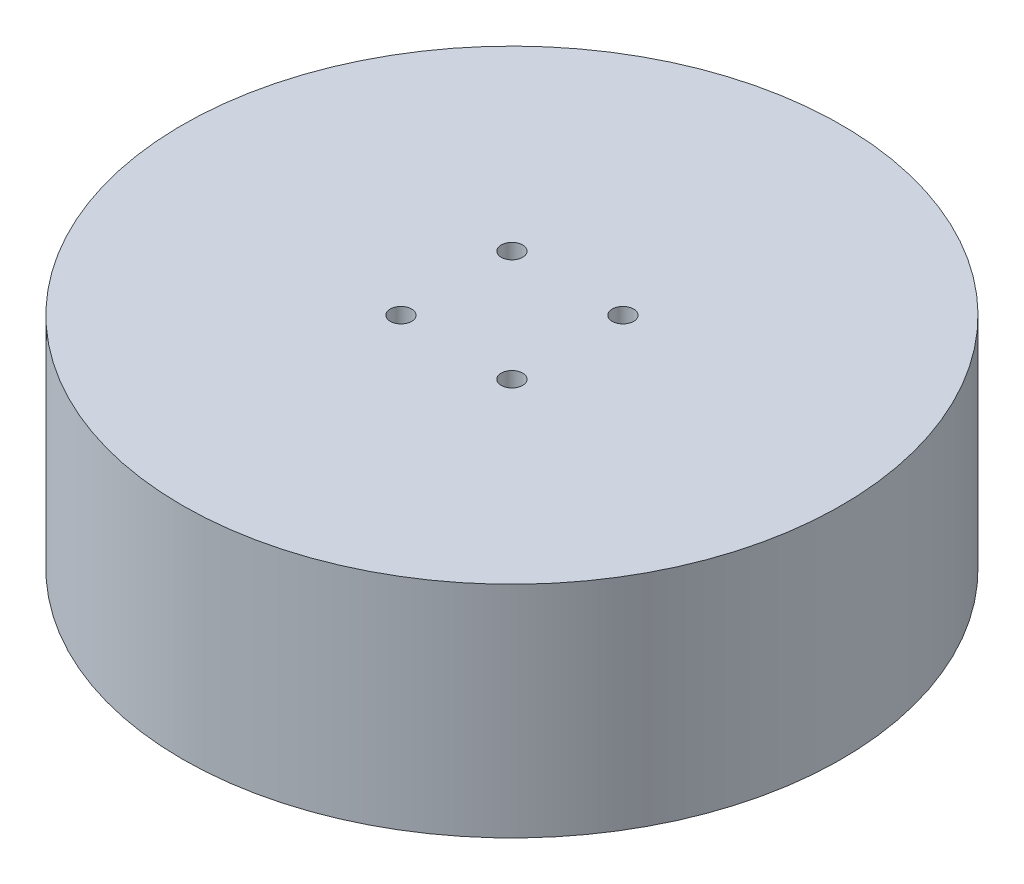
ISO-10303-21;
HEADER;
FILE_DESCRIPTION(('STEP AP214'),'2;1');
FILE_NAME('part.step','',(''),(''),'','','');
FILE_SCHEMA(('AUTOMOTIVE_DESIGN { 1 0 10303 214 1 1 1 1 }'));
ENDSEC;
DATA;
#1=APPLICATION_CONTEXT('core data for automotive mechanical design processes');
#2=APPLICATION_PROTOCOL_DEFINITION('international standard','automotive_design',2000,#1);
#3=PRODUCT_CONTEXT('',#1,'mechanical');
#4=PRODUCT('Part','Part','',(#3));
#5=PRODUCT_RELATED_PRODUCT_CATEGORY('part','',(#4));
#6=PRODUCT_DEFINITION_FORMATION('','',#4);
#7=PRODUCT_DEFINITION_CONTEXT('part definition',#1,'design');
#8=PRODUCT_DEFINITION('design','',#6,#7);
#9=PRODUCT_DEFINITION_SHAPE('','',#8);
#10=(LENGTH_UNIT() NAMED_UNIT(*) SI_UNIT(.MILLI.,.METRE.));
#11=(NAMED_UNIT(*) PLANE_ANGLE_UNIT() SI_UNIT($,.RADIAN.));
#12=(NAMED_UNIT(*) SI_UNIT($,.STERADIAN.) SOLID_ANGLE_UNIT());
#13=UNCERTAINTY_MEASURE_WITH_UNIT(LENGTH_MEASURE(1.E-05),#10,'distance_accuracy_value','');
#14=(GEOMETRIC_REPRESENTATION_CONTEXT(3) GLOBAL_UNCERTAINTY_ASSIGNED_CONTEXT((#13)) GLOBAL_UNIT_ASSIGNED_CONTEXT((#10,
#11,#12)) REPRESENTATION_CONTEXT('',''));
#15=CARTESIAN_POINT('',(0.,0.,0.));
#16=DIRECTION('',(0.,0.,1.));
#17=DIRECTION('',(1.,0.,0.));
#18=AXIS2_PLACEMENT_3D('',#15,#16,#17);
#19=CARTESIAN_POINT('',(0.,21.,0.));
#20=DIRECTION('',(0.,-1.,0.));
#21=DIRECTION('',(0.,0.,-1.));
#22=AXIS2_PLACEMENT_3D('',#19,#20,#21);
#23=CYLINDRICAL_SURFACE('',#22,31.5);
#24=CARTESIAN_POINT('',(0.,21.,0.));
#25=DIRECTION('',(0.,1.,0.));
#26=DIRECTION('',(0.,0.,1.));
#27=AXIS2_PLACEMENT_3D('',#24,#25,#26);
#28=CIRCLE('',#27,31.5);
#29=CARTESIAN_POINT('',(0.,21.,31.5));
#30=VERTEX_POINT('',#29);
#31=EDGE_CURVE('E11',#30,#30,#28,.T.);
#32=ORIENTED_EDGE('',*,*,#31,.F.);
#33=EDGE_LOOP('',(#32));
#34=FACE_BOUND('',#33,.T.);
#35=CARTESIAN_POINT('',(0.,0.,0.));
#36=DIRECTION('',(0.,1.,0.));
#37=DIRECTION('',(0.,0.,1.));
#38=AXIS2_PLACEMENT_3D('',#35,#36,#37);
#39=CIRCLE('',#38,31.5);
#40=CARTESIAN_POINT('',(0.,0.,31.5));
#41=VERTEX_POINT('',#40);
#42=EDGE_CURVE('E36',#41,#41,#39,.T.);
#43=ORIENTED_EDGE('',*,*,#42,.T.);
#44=EDGE_LOOP('',(#43));
#45=FACE_BOUND('',#44,.T.);
#46=ADVANCED_FACE('F33',(#34,#45),#23,.T.);
#47=CARTESIAN_POINT('',(0.,21.,0.));
#48=DIRECTION('',(0.,1.,0.));
#49=DIRECTION('',(0.,0.,1.));
#50=AXIS2_PLACEMENT_3D('',#47,#48,#49);
#51=PLANE('',#50);
#52=CARTESIAN_POINT('',(-5.30330085889914,21.,-5.30330085889908));
#53=DIRECTION('',(0.,1.,0.));
#54=DIRECTION('',(0.,0.,1.));
#55=AXIS2_PLACEMENT_3D('',#52,#53,#54);
#56=CIRCLE('',#55,1.02499999999999);
#57=CARTESIAN_POINT('',(-5.30330085889914,21.,-4.27830085889909));
#58=VERTEX_POINT('',#57);
#59=EDGE_CURVE('E64',#58,#58,#56,.T.);
#60=ORIENTED_EDGE('',*,*,#59,.F.);
#61=EDGE_LOOP('',(#60));
#62=FACE_BOUND('',#61,.T.);
#63=CARTESIAN_POINT('',(5.3033008588991,21.,-5.30330085889912));
#64=DIRECTION('',(0.,1.,0.));
#65=DIRECTION('',(0.,0.,1.));
#66=AXIS2_PLACEMENT_3D('',#63,#64,#65);
#67=CIRCLE('',#66,1.02499999999999);
#68=CARTESIAN_POINT('',(5.3033008588991,21.,-4.27830085889913));
#69=VERTEX_POINT('',#68);
#70=EDGE_CURVE('E63',#69,#69,#67,.T.);
#71=ORIENTED_EDGE('',*,*,#70,.F.);
#72=EDGE_LOOP('',(#71));
#73=FACE_BOUND('',#72,.T.);
#74=CARTESIAN_POINT('',(5.30330085889911,21.,5.30330085889911));
#75=DIRECTION('',(0.,1.,0.));
#76=DIRECTION('',(0.,0.,1.));
#77=AXIS2_PLACEMENT_3D('',#74,#75,#76);
#78=CIRCLE('',#77,1.02499999999999);
#79=CARTESIAN_POINT('',(5.30330085889911,21.,6.3283008588991));
#80=VERTEX_POINT('',#79);
#81=EDGE_CURVE('E76',#80,#80,#78,.T.);
#82=ORIENTED_EDGE('',*,*,#81,.F.);
#83=EDGE_LOOP('',(#82));
#84=FACE_BOUND('',#83,.T.);
#85=CARTESIAN_POINT('',(-5.30330085889914,21.,5.30330085889908));
#86=DIRECTION('',(0.,1.,0.));
#87=DIRECTION('',(0.,0.,1.));
#88=AXIS2_PLACEMENT_3D('',#85,#86,#87);
#89=CIRCLE('',#88,1.02499999999999);
#90=CARTESIAN_POINT('',(-5.30330085889914,21.,6.32830085889907));
#91=VERTEX_POINT('',#90);
#92=EDGE_CURVE('E82',#91,#91,#89,.T.);
#93=ORIENTED_EDGE('',*,*,#92,.F.);
#94=EDGE_LOOP('',(#93));
#95=FACE_BOUND('',#94,.T.);
#96=ORIENTED_EDGE('',*,*,#31,.T.);
#97=EDGE_LOOP('',(#96));
#98=FACE_BOUND('',#97,.T.);
#99=ADVANCED_FACE('F96',(#62,#73,#84,#95,#98),#51,.T.);
#100=CARTESIAN_POINT('',(0.,0.,0.));
#101=DIRECTION('',(0.,1.,0.));
#102=DIRECTION('',(0.,0.,1.));
#103=AXIS2_PLACEMENT_3D('',#100,#101,#102);
#104=PLANE('',#103);
#105=CARTESIAN_POINT('',(0.,0.,0.));
#106=DIRECTION('',(0.,-1.,0.));
#107=DIRECTION('',(0.,0.,-1.));
#108=AXIS2_PLACEMENT_3D('',#105,#106,#107);
#109=CIRCLE('',#108,27.);
#110=CARTESIAN_POINT('',(0.,0.,-27.));
#111=VERTEX_POINT('',#110);
#112=EDGE_CURVE('E214',#111,#111,#109,.T.);
#113=ORIENTED_EDGE('',*,*,#112,.F.);
#114=EDGE_LOOP('',(#113));
#115=FACE_BOUND('',#114,.T.);
#116=ORIENTED_EDGE('',*,*,#42,.F.);
#117=EDGE_LOOP('',(#116));
#118=FACE_BOUND('',#117,.T.);
#119=ADVANCED_FACE('F93',(#115,#118),#104,.F.);
#120=CARTESIAN_POINT('',(-5.30330085889914,14.,5.30330085889908));
#121=DIRECTION('',(0.,1.,0.));
#122=DIRECTION('',(0.,0.,1.));
#123=AXIS2_PLACEMENT_3D('',#120,#121,#122);
#124=CONICAL_SURFACE('',#123,1.02499999999999,1.02974425867664);
#125=CARTESIAN_POINT('',(-5.30330085889914,13.3841178654968,5.30330085889908));
#126=VERTEX_POINT('',#125);
#127=VERTEX_LOOP('',#126);
#128=FACE_BOUND('',#127,.T.);
#129=CARTESIAN_POINT('',(-5.30330085889914,14.,5.30330085889908));
#130=DIRECTION('',(0.,1.,0.));
#131=DIRECTION('',(0.,0.,1.));
#132=AXIS2_PLACEMENT_3D('',#129,#130,#131);
#133=CIRCLE('',#132,1.02499999999999);
#134=CARTESIAN_POINT('',(-5.30330085889914,14.,6.32830085889907));
#135=VERTEX_POINT('',#134);
#136=EDGE_CURVE('E85',#135,#135,#133,.T.);
#137=ORIENTED_EDGE('',*,*,#136,.T.);
#138=EDGE_LOOP('',(#137));
#139=FACE_BOUND('',#138,.T.);
#140=ADVANCED_FACE('F95',(#128,#139),#124,.F.);
#141=CARTESIAN_POINT('',(-5.30330085889914,21.,5.30330085889908));
#142=DIRECTION('',(0.,1.,0.));
#143=DIRECTION('',(0.,0.,1.));
#144=AXIS2_PLACEMENT_3D('',#141,#142,#143);
#145=CYLINDRICAL_SURFACE('',#144,1.02499999999999);
#146=ORIENTED_EDGE('',*,*,#136,.F.);
#147=EDGE_LOOP('',(#146));
#148=FACE_BOUND('',#147,.T.);
#149=ORIENTED_EDGE('',*,*,#92,.T.);
#150=EDGE_LOOP('',(#149));
#151=FACE_BOUND('',#150,.T.);
#152=ADVANCED_FACE('F102',(#148,#151),#145,.F.);
#153=CARTESIAN_POINT('',(5.30330085889911,14.,5.30330085889911));
#154=DIRECTION('',(0.,1.,0.));
#155=DIRECTION('',(0.,0.,1.));
#156=AXIS2_PLACEMENT_3D('',#153,#154,#155);
#157=CONICAL_SURFACE('',#156,1.02499999999999,1.02974425867664);
#158=CARTESIAN_POINT('',(5.3033008588991,13.3841178654968,5.30330085889911));
#159=VERTEX_POINT('',#158);
#160=VERTEX_LOOP('',#159);
#161=FACE_BOUND('',#160,.T.);
#162=CARTESIAN_POINT('',(5.30330085889911,14.,5.30330085889911));
#163=DIRECTION('',(0.,1.,0.));
#164=DIRECTION('',(0.,0.,1.));
#165=AXIS2_PLACEMENT_3D('',#162,#163,#164);
#166=CIRCLE('',#165,1.02499999999999);
#167=CARTESIAN_POINT('',(5.30330085889911,14.,6.32830085889909));
#168=VERTEX_POINT('',#167);
#169=EDGE_CURVE('E79',#168,#168,#166,.T.);
#170=ORIENTED_EDGE('',*,*,#169,.T.);
#171=EDGE_LOOP('',(#170));
#172=FACE_BOUND('',#171,.T.);
#173=ADVANCED_FACE('F133',(#161,#172),#157,.F.);
#174=CARTESIAN_POINT('',(5.30330085889911,21.,5.30330085889911));
#175=DIRECTION('',(0.,1.,0.));
#176=DIRECTION('',(0.,0.,1.));
#177=AXIS2_PLACEMENT_3D('',#174,#175,#176);
#178=CYLINDRICAL_SURFACE('',#177,1.02499999999999);
#179=ORIENTED_EDGE('',*,*,#169,.F.);
#180=EDGE_LOOP('',(#179));
#181=FACE_BOUND('',#180,.T.);
#182=ORIENTED_EDGE('',*,*,#81,.T.);
#183=EDGE_LOOP('',(#182));
#184=FACE_BOUND('',#183,.T.);
#185=ADVANCED_FACE('F143',(#181,#184),#178,.F.);
#186=CARTESIAN_POINT('',(5.3033008588991,14.,-5.30330085889912));
#187=DIRECTION('',(0.,1.,0.));
#188=DIRECTION('',(0.,0.,1.));
#189=AXIS2_PLACEMENT_3D('',#186,#187,#188);
#190=CONICAL_SURFACE('',#189,1.02499999999999,1.02974425867664);
#191=CARTESIAN_POINT('',(5.3033008588991,13.3841178654968,-5.30330085889912));
#192=VERTEX_POINT('',#191);
#193=VERTEX_LOOP('',#192);
#194=FACE_BOUND('',#193,.T.);
#195=CARTESIAN_POINT('',(5.3033008588991,14.,-5.30330085889912));
#196=DIRECTION('',(0.,1.,0.));
#197=DIRECTION('',(0.,0.,1.));
#198=AXIS2_PLACEMENT_3D('',#195,#196,#197);
#199=CIRCLE('',#198,1.02499999999999);
#200=CARTESIAN_POINT('',(5.3033008588991,14.,-4.27830085889913));
#201=VERTEX_POINT('',#200);
#202=EDGE_CURVE('E67',#201,#201,#199,.T.);
#203=ORIENTED_EDGE('',*,*,#202,.T.);
#204=EDGE_LOOP('',(#203));
#205=FACE_BOUND('',#204,.T.);
#206=ADVANCED_FACE('F152',(#194,#205),#190,.F.);
#207=CARTESIAN_POINT('',(5.3033008588991,21.,-5.30330085889912));
#208=DIRECTION('',(0.,1.,0.));
#209=DIRECTION('',(0.,0.,1.));
#210=AXIS2_PLACEMENT_3D('',#207,#208,#209);
#211=CYLINDRICAL_SURFACE('',#210,1.02499999999999);
#212=ORIENTED_EDGE('',*,*,#202,.F.);
#213=EDGE_LOOP('',(#212));
#214=FACE_BOUND('',#213,.T.);
#215=ORIENTED_EDGE('',*,*,#70,.T.);
#216=EDGE_LOOP('',(#215));
#217=FACE_BOUND('',#216,.T.);
#218=ADVANCED_FACE('F57',(#214,#217),#211,.F.);
#219=CARTESIAN_POINT('',(-5.30330085889914,14.,-5.30330085889908));
#220=DIRECTION('',(0.,1.,0.));
#221=DIRECTION('',(0.,0.,1.));
#222=AXIS2_PLACEMENT_3D('',#219,#220,#221);
#223=CONICAL_SURFACE('',#222,1.02499999999999,1.02974425867664);
#224=CARTESIAN_POINT('',(-5.30330085889914,13.3841178654968,-5.30330085889908));
#225=VERTEX_POINT('',#224);
#226=VERTEX_LOOP('',#225);
#227=FACE_BOUND('',#226,.T.);
#228=CARTESIAN_POINT('',(-5.30330085889914,14.,-5.30330085889908));
#229=DIRECTION('',(0.,1.,0.));
#230=DIRECTION('',(0.,0.,1.));
#231=AXIS2_PLACEMENT_3D('',#228,#229,#230);
#232=CIRCLE('',#231,1.02499999999999);
#233=CARTESIAN_POINT('',(-5.30330085889914,14.,-4.27830085889909));
#234=VERTEX_POINT('',#233);
#235=EDGE_CURVE('E61',#234,#234,#232,.T.);
#236=ORIENTED_EDGE('',*,*,#235,.T.);
#237=EDGE_LOOP('',(#236));
#238=FACE_BOUND('',#237,.T.);
#239=ADVANCED_FACE('F53',(#227,#238),#223,.F.);
#240=CARTESIAN_POINT('',(-5.30330085889914,21.,-5.30330085889908));
#241=DIRECTION('',(0.,1.,0.));
#242=DIRECTION('',(0.,0.,1.));
#243=AXIS2_PLACEMENT_3D('',#240,#241,#242);
#244=CYLINDRICAL_SURFACE('',#243,1.02499999999999);
#245=ORIENTED_EDGE('',*,*,#235,.F.);
#246=EDGE_LOOP('',(#245));
#247=FACE_BOUND('',#246,.T.);
#248=ORIENTED_EDGE('',*,*,#59,.T.);
#249=EDGE_LOOP('',(#248));
#250=FACE_BOUND('',#249,.T.);
#251=ADVANCED_FACE('F56',(#247,#250),#244,.F.);
#252=CARTESIAN_POINT('',(0.,10.,0.));
#253=DIRECTION('',(0.,-1.,0.));
#254=DIRECTION('',(0.,0.,-1.));
#255=AXIS2_PLACEMENT_3D('',#252,#253,#254);
#256=CYLINDRICAL_SURFACE('',#255,27.);
#257=CARTESIAN_POINT('',(0.,10.,0.));
#258=DIRECTION('',(0.,-1.,0.));
#259=DIRECTION('',(0.,0.,-1.));
#260=AXIS2_PLACEMENT_3D('',#257,#258,#259);
#261=CIRCLE('',#260,27.);
#262=CARTESIAN_POINT('',(0.,10.,-27.));
#263=VERTEX_POINT('',#262);
#264=EDGE_CURVE('E70',#263,#263,#261,.T.);
#265=ORIENTED_EDGE('',*,*,#264,.F.);
#266=EDGE_LOOP('',(#265));
#267=FACE_BOUND('',#266,.T.);
#268=ORIENTED_EDGE('',*,*,#112,.T.);
#269=EDGE_LOOP('',(#268));
#270=FACE_BOUND('',#269,.T.);
#271=ADVANCED_FACE('F185',(#267,#270),#256,.F.);
#272=CARTESIAN_POINT('',(0.,10.,0.));
#273=DIRECTION('',(0.,-1.,0.));
#274=DIRECTION('',(0.,0.,-1.));
#275=AXIS2_PLACEMENT_3D('',#272,#273,#274);
#276=PLANE('',#275);
#277=ORIENTED_EDGE('',*,*,#264,.T.);
#278=EDGE_LOOP('',(#277));
#279=FACE_BOUND('',#278,.T.);
#280=ADVANCED_FACE('F198',(#279),#276,.T.);
#281=CLOSED_SHELL('',(#46,#99,#119,#140,#152,#173,#185,#206,#218,#239,#251,#271,#280));
#282=MANIFOLD_SOLID_BREP('B2',#281);
#283=ADVANCED_BREP_SHAPE_REPRESENTATION('',(#18,#282),#14);
#284=SHAPE_DEFINITION_REPRESENTATION(#9,#283);
ENDSEC;
END-ISO-10303-21;
